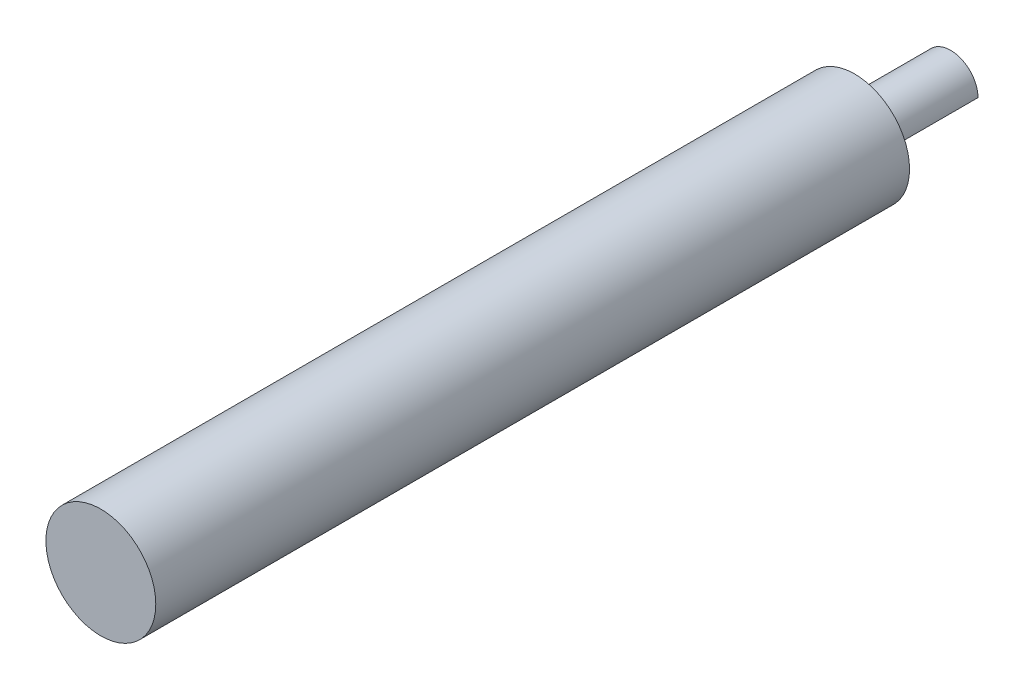
ISO-10303-21;
HEADER;
FILE_DESCRIPTION(('STEP AP214'),'2;1');
FILE_NAME('part.step','',(''),(''),'','','');
FILE_SCHEMA(('AUTOMOTIVE_DESIGN { 1 0 10303 214 1 1 1 1 }'));
ENDSEC;
DATA;
#1=APPLICATION_CONTEXT('core data for automotive mechanical design processes');
#2=APPLICATION_PROTOCOL_DEFINITION('international standard','automotive_design',2000,#1);
#3=PRODUCT_CONTEXT('',#1,'mechanical');
#4=PRODUCT('Part','Part','',(#3));
#5=PRODUCT_RELATED_PRODUCT_CATEGORY('part','',(#4));
#6=PRODUCT_DEFINITION_FORMATION('','',#4);
#7=PRODUCT_DEFINITION_CONTEXT('part definition',#1,'design');
#8=PRODUCT_DEFINITION('design','',#6,#7);
#9=PRODUCT_DEFINITION_SHAPE('','',#8);
#10=(LENGTH_UNIT() NAMED_UNIT(*) SI_UNIT(.MILLI.,.METRE.));
#11=(NAMED_UNIT(*) PLANE_ANGLE_UNIT() SI_UNIT($,.RADIAN.));
#12=(NAMED_UNIT(*) SI_UNIT($,.STERADIAN.) SOLID_ANGLE_UNIT());
#13=UNCERTAINTY_MEASURE_WITH_UNIT(LENGTH_MEASURE(1.E-05),#10,'distance_accuracy_value','');
#14=(GEOMETRIC_REPRESENTATION_CONTEXT(3) GLOBAL_UNCERTAINTY_ASSIGNED_CONTEXT((#13)) GLOBAL_UNIT_ASSIGNED_CONTEXT((#10,
#11,#12)) REPRESENTATION_CONTEXT('',''));
#15=CARTESIAN_POINT('',(0.,0.,0.));
#16=DIRECTION('',(0.,0.,1.));
#17=DIRECTION('',(1.,0.,0.));
#18=AXIS2_PLACEMENT_3D('',#15,#16,#17);
#19=CARTESIAN_POINT('',(0.,0.,11.0998));
#20=DIRECTION('',(0.,0.,-1.));
#21=DIRECTION('',(-1.,0.,0.));
#22=AXIS2_PLACEMENT_3D('',#19,#20,#21);
#23=CYLINDRICAL_SURFACE('',#22,3.1623);
#24=DIRECTION('',(0.,0.,1.));
#25=VECTOR('',#24,1.);
#26=CARTESIAN_POINT('',(-0.00124959849113495,-3.16229975310748,-31.6935730163358));
#27=LINE('',#26,#25);
#28=CARTESIAN_POINT('',(-0.00124959849113538,-3.16229975310748,0.));
#29=VERTEX_POINT('',#28);
#30=CARTESIAN_POINT('',(-0.00124959849113538,-3.16229975310748,11.0998));
#31=VERTEX_POINT('',#30);
#32=EDGE_CURVE('E49',#29,#31,#27,.T.);
#33=ORIENTED_EDGE('',*,*,#32,.T.);
#34=CARTESIAN_POINT('',(0.,0.,11.0998));
#35=DIRECTION('',(0.,0.,1.));
#36=DIRECTION('',(1.,0.,0.));
#37=AXIS2_PLACEMENT_3D('',#34,#35,#36);
#38=CIRCLE('',#37,3.1623);
#39=CARTESIAN_POINT('',(3.16229975310748,0.00124959849113582,11.0998));
#40=VERTEX_POINT('',#39);
#41=EDGE_CURVE('E42',#40,#31,#38,.T.);
#42=ORIENTED_EDGE('',*,*,#41,.F.);
#43=DIRECTION('',(0.,0.,1.));
#44=VECTOR('',#43,1.);
#45=CARTESIAN_POINT('',(3.16229975310748,0.0012495984911356,-31.6935730163358));
#46=LINE('',#45,#44);
#47=CARTESIAN_POINT('',(3.16229975310748,0.0012495984911356,0.));
#48=VERTEX_POINT('',#47);
#49=EDGE_CURVE('E61',#48,#40,#46,.T.);
#50=ORIENTED_EDGE('',*,*,#49,.F.);
#51=CARTESIAN_POINT('',(0.,0.,0.));
#52=DIRECTION('',(0.,0.,1.));
#53=DIRECTION('',(1.,0.,0.));
#54=AXIS2_PLACEMENT_3D('',#51,#52,#53);
#55=CIRCLE('',#54,3.1623);
#56=EDGE_CURVE('E68',#48,#29,#55,.T.);
#57=ORIENTED_EDGE('',*,*,#56,.T.);
#58=EDGE_LOOP('',(#33,#42,#50,#57));
#59=FACE_BOUND('',#58,.T.);
#60=ADVANCED_FACE('F35',(#59),#23,.T.);
#61=CARTESIAN_POINT('',(0.,0.,0.));
#62=DIRECTION('',(0.,0.,1.));
#63=DIRECTION('',(1.,0.,0.));
#64=AXIS2_PLACEMENT_3D('',#61,#62,#63);
#65=PLANE('',#64);
#66=DIRECTION('',(0.707106781186547,0.707106781186548,0.));
#67=VECTOR('',#66,1.);
#68=CARTESIAN_POINT('',(1.58052507730817,-1.58052507730817,0.));
#69=LINE('',#68,#67);
#70=EDGE_CURVE('E11',#29,#48,#69,.T.);
#71=ORIENTED_EDGE('',*,*,#70,.F.);
#72=ORIENTED_EDGE('',*,*,#56,.F.);
#73=EDGE_LOOP('',(#71,#72));
#74=FACE_BOUND('',#73,.T.);
#75=ADVANCED_FACE('F94',(#74),#65,.F.);
#76=CARTESIAN_POINT('',(-0.00124959849113495,-3.16229975310748,-31.6935730163358));
#77=DIRECTION('',(0.707106781186547,-0.707106781186547,0.));
#78=DIRECTION('',(0.707106781186547,0.707106781186548,0.));
#79=AXIS2_PLACEMENT_3D('',#76,#77,#78);
#80=PLANE('',#79);
#81=DIRECTION('',(0.707106781186547,0.707106781186548,0.));
#82=VECTOR('',#81,1.);
#83=CARTESIAN_POINT('',(1.58052507730817,-1.58052507730817,11.0998));
#84=LINE('',#83,#82);
#85=EDGE_CURVE('E64',#31,#40,#84,.T.);
#86=ORIENTED_EDGE('',*,*,#85,.F.);
#87=ORIENTED_EDGE('',*,*,#32,.F.);
#88=ORIENTED_EDGE('',*,*,#70,.T.);
#89=ORIENTED_EDGE('',*,*,#49,.T.);
#90=EDGE_LOOP('',(#86,#87,#88,#89));
#91=FACE_BOUND('',#90,.T.);
#92=ADVANCED_FACE('F62',(#91),#80,.T.);
#93=CARTESIAN_POINT('',(0.,0.,11.0998));
#94=DIRECTION('',(0.,0.,1.));
#95=DIRECTION('',(1.,0.,0.));
#96=AXIS2_PLACEMENT_3D('',#93,#94,#95);
#97=PLANE('',#96);
#98=CARTESIAN_POINT('',(0.,0.,11.0998));
#99=DIRECTION('',(0.,0.,1.));
#100=DIRECTION('',(1.,0.,0.));
#101=AXIS2_PLACEMENT_3D('',#98,#99,#100);
#102=CIRCLE('',#101,6.35);
#103=CARTESIAN_POINT('',(6.35,0.,11.0998));
#104=VERTEX_POINT('',#103);
#105=EDGE_CURVE('E75',#104,#104,#102,.T.);
#106=ORIENTED_EDGE('',*,*,#105,.F.);
#107=EDGE_LOOP('',(#106));
#108=FACE_BOUND('',#107,.T.);
#109=ORIENTED_EDGE('',*,*,#85,.T.);
#110=ORIENTED_EDGE('',*,*,#41,.T.);
#111=EDGE_LOOP('',(#109,#110));
#112=FACE_BOUND('',#111,.T.);
#113=ADVANCED_FACE('F70',(#108,#112),#97,.F.);
#114=CARTESIAN_POINT('',(0.,0.,98.2218));
#115=DIRECTION('',(0.,0.,-1.));
#116=DIRECTION('',(-1.,0.,0.));
#117=AXIS2_PLACEMENT_3D('',#114,#115,#116);
#118=CYLINDRICAL_SURFACE('',#117,6.35);
#119=CARTESIAN_POINT('',(0.,0.,98.2218));
#120=DIRECTION('',(0.,0.,1.));
#121=DIRECTION('',(1.,0.,0.));
#122=AXIS2_PLACEMENT_3D('',#119,#120,#121);
#123=CIRCLE('',#122,6.35);
#124=CARTESIAN_POINT('',(6.35,0.,98.2218));
#125=VERTEX_POINT('',#124);
#126=EDGE_CURVE('E73',#125,#125,#123,.T.);
#127=ORIENTED_EDGE('',*,*,#126,.F.);
#128=EDGE_LOOP('',(#127));
#129=FACE_BOUND('',#128,.T.);
#130=ORIENTED_EDGE('',*,*,#105,.T.);
#131=EDGE_LOOP('',(#130));
#132=FACE_BOUND('',#131,.T.);
#133=ADVANCED_FACE('F83',(#129,#132),#118,.T.);
#134=CARTESIAN_POINT('',(0.,0.,98.2218));
#135=DIRECTION('',(0.,0.,1.));
#136=DIRECTION('',(1.,0.,0.));
#137=AXIS2_PLACEMENT_3D('',#134,#135,#136);
#138=PLANE('',#137);
#139=ORIENTED_EDGE('',*,*,#126,.T.);
#140=EDGE_LOOP('',(#139));
#141=FACE_BOUND('',#140,.T.);
#142=ADVANCED_FACE('F81',(#141),#138,.T.);
#143=CLOSED_SHELL('',(#60,#75,#92,#113,#133,#142));
#144=MANIFOLD_SOLID_BREP('B2',#143);
#145=ADVANCED_BREP_SHAPE_REPRESENTATION('',(#18,#144),#14);
#146=SHAPE_DEFINITION_REPRESENTATION(#9,#145);
ENDSEC;
END-ISO-10303-21;
